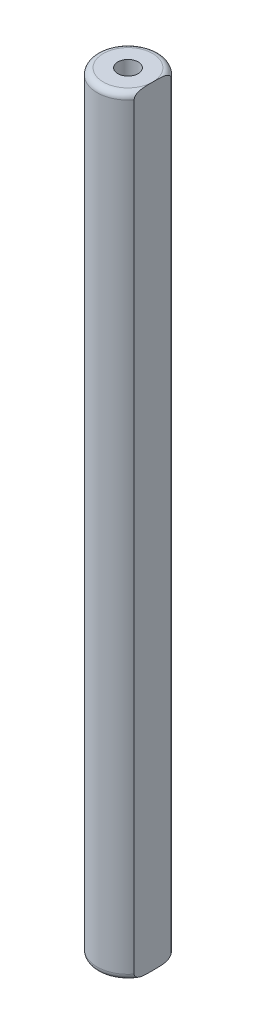
ISO-10303-21;
HEADER;
FILE_DESCRIPTION(('STEP AP214'),'2;1');
FILE_NAME('part.step','',(''),(''),'','','');
FILE_SCHEMA(('AUTOMOTIVE_DESIGN { 1 0 10303 214 1 1 1 1 }'));
ENDSEC;
DATA;
#1=APPLICATION_CONTEXT('core data for automotive mechanical design processes');
#2=APPLICATION_PROTOCOL_DEFINITION('international standard','automotive_design',2000,#1);
#3=PRODUCT_CONTEXT('',#1,'mechanical');
#4=PRODUCT('Part','Part','',(#3));
#5=PRODUCT_RELATED_PRODUCT_CATEGORY('part','',(#4));
#6=PRODUCT_DEFINITION_FORMATION('','',#4);
#7=PRODUCT_DEFINITION_CONTEXT('part definition',#1,'design');
#8=PRODUCT_DEFINITION('design','',#6,#7);
#9=PRODUCT_DEFINITION_SHAPE('','',#8);
#10=(LENGTH_UNIT() NAMED_UNIT(*) SI_UNIT(.MILLI.,.METRE.));
#11=(NAMED_UNIT(*) PLANE_ANGLE_UNIT() SI_UNIT($,.RADIAN.));
#12=(NAMED_UNIT(*) SI_UNIT($,.STERADIAN.) SOLID_ANGLE_UNIT());
#13=UNCERTAINTY_MEASURE_WITH_UNIT(LENGTH_MEASURE(1.E-05),#10,'distance_accuracy_value','');
#14=(GEOMETRIC_REPRESENTATION_CONTEXT(3) GLOBAL_UNCERTAINTY_ASSIGNED_CONTEXT((#13)) GLOBAL_UNIT_ASSIGNED_CONTEXT((#10,
#11,#12)) REPRESENTATION_CONTEXT('',''));
#15=CARTESIAN_POINT('',(0.,0.,0.));
#16=DIRECTION('',(0.,0.,1.));
#17=DIRECTION('',(1.,0.,0.));
#18=AXIS2_PLACEMENT_3D('',#15,#16,#17);
#19=CARTESIAN_POINT('',(0.,31.15,0.));
#20=DIRECTION('',(0.,-1.,0.));
#21=DIRECTION('',(0.,0.,-1.));
#22=AXIS2_PLACEMENT_3D('',#19,#20,#21);
#23=CYLINDRICAL_SURFACE('',#22,2.5);
#24=DIRECTION('',(0.,1.,0.));
#25=VECTOR('',#24,1.);
#26=CARTESIAN_POINT('',(2.,0.,-1.5));
#27=LINE('',#26,#25);
#28=CARTESIAN_POINT('',(2.,-30.65,-1.5));
#29=VERTEX_POINT('',#28);
#30=CARTESIAN_POINT('',(2.,30.65,-1.5));
#31=VERTEX_POINT('',#30);
#32=EDGE_CURVE('E80',#29,#31,#27,.T.);
#33=ORIENTED_EDGE('',*,*,#32,.F.);
#34=CARTESIAN_POINT('',(0.,-30.65,0.));
#35=DIRECTION('',(0.,-1.,0.));
#36=DIRECTION('',(0.,0.,-1.));
#37=AXIS2_PLACEMENT_3D('',#34,#35,#36);
#38=CIRCLE('',#37,2.5);
#39=CARTESIAN_POINT('',(2.,-30.65,1.5));
#40=VERTEX_POINT('',#39);
#41=EDGE_CURVE('E117',#29,#40,#38,.F.);
#42=ORIENTED_EDGE('',*,*,#41,.T.);
#43=DIRECTION('',(0.,1.,0.));
#44=VECTOR('',#43,1.);
#45=CARTESIAN_POINT('',(2.,0.,1.5));
#46=LINE('',#45,#44);
#47=CARTESIAN_POINT('',(2.,30.65,1.5));
#48=VERTEX_POINT('',#47);
#49=EDGE_CURVE('E122',#40,#48,#46,.T.);
#50=ORIENTED_EDGE('',*,*,#49,.T.);
#51=CARTESIAN_POINT('',(0.,30.65,0.));
#52=DIRECTION('',(0.,1.,0.));
#53=DIRECTION('',(0.,0.,1.));
#54=AXIS2_PLACEMENT_3D('',#51,#52,#53);
#55=CIRCLE('',#54,2.5);
#56=EDGE_CURVE('E75',#48,#31,#55,.F.);
#57=ORIENTED_EDGE('',*,*,#56,.T.);
#58=EDGE_LOOP('',(#33,#42,#50,#57));
#59=FACE_BOUND('',#58,.T.);
#60=ADVANCED_FACE('F33',(#59),#23,.T.);
#61=CARTESIAN_POINT('',(0.,-31.15,0.));
#62=DIRECTION('',(0.,-1.,0.));
#63=DIRECTION('',(0.,0.,1.));
#64=AXIS2_PLACEMENT_3D('',#61,#62,#63);
#65=PLANE('',#64);
#66=CARTESIAN_POINT('',(0.,-31.15,0.));
#67=DIRECTION('',(0.,-1.,0.));
#68=DIRECTION('',(0.,0.,-1.));
#69=AXIS2_PLACEMENT_3D('',#66,#67,#68);
#70=CIRCLE('',#69,2.);
#71=CARTESIAN_POINT('',(2.,-31.15,0.));
#72=VERTEX_POINT('',#71);
#73=EDGE_CURVE('E11',#72,#72,#70,.T.);
#74=ORIENTED_EDGE('',*,*,#73,.T.);
#75=EDGE_LOOP('',(#74));
#76=FACE_BOUND('',#75,.T.);
#77=CARTESIAN_POINT('',(0.,-31.15,0.));
#78=DIRECTION('',(0.,1.,0.));
#79=DIRECTION('',(0.,0.,1.));
#80=AXIS2_PLACEMENT_3D('',#77,#78,#79);
#81=CIRCLE('',#80,0.825);
#82=CARTESIAN_POINT('',(0.,-31.15,0.825));
#83=VERTEX_POINT('',#82);
#84=EDGE_CURVE('E134',#83,#83,#81,.T.);
#85=ORIENTED_EDGE('',*,*,#84,.T.);
#86=EDGE_LOOP('',(#85));
#87=FACE_BOUND('',#86,.T.);
#88=ADVANCED_FACE('F106',(#76,#87),#65,.T.);
#89=CARTESIAN_POINT('',(0.,31.15,0.));
#90=DIRECTION('',(0.,1.,0.));
#91=DIRECTION('',(0.,0.,1.));
#92=AXIS2_PLACEMENT_3D('',#89,#90,#91);
#93=PLANE('',#92);
#94=CARTESIAN_POINT('',(0.,31.15,0.));
#95=DIRECTION('',(0.,1.,0.));
#96=DIRECTION('',(0.,0.,1.));
#97=AXIS2_PLACEMENT_3D('',#94,#95,#96);
#98=CIRCLE('',#97,2.);
#99=CARTESIAN_POINT('',(2.,31.15,0.));
#100=VERTEX_POINT('',#99);
#101=EDGE_CURVE('E73',#100,#100,#98,.T.);
#102=ORIENTED_EDGE('',*,*,#101,.T.);
#103=EDGE_LOOP('',(#102));
#104=FACE_BOUND('',#103,.T.);
#105=CARTESIAN_POINT('',(0.,31.15,0.));
#106=DIRECTION('',(0.,1.,0.));
#107=DIRECTION('',(0.,0.,1.));
#108=AXIS2_PLACEMENT_3D('',#105,#106,#107);
#109=CIRCLE('',#108,0.825);
#110=CARTESIAN_POINT('',(0.,31.15,0.825));
#111=VERTEX_POINT('',#110);
#112=EDGE_CURVE('E88',#111,#111,#109,.T.);
#113=ORIENTED_EDGE('',*,*,#112,.F.);
#114=EDGE_LOOP('',(#113));
#115=FACE_BOUND('',#114,.T.);
#116=ADVANCED_FACE('F83',(#104,#115),#93,.T.);
#117=CARTESIAN_POINT('',(0.,26.15,0.));
#118=DIRECTION('',(0.,1.,0.));
#119=DIRECTION('',(0.,0.,1.));
#120=AXIS2_PLACEMENT_3D('',#117,#118,#119);
#121=CYLINDRICAL_SURFACE('',#120,0.825);
#122=CARTESIAN_POINT('',(0.,26.15,0.));
#123=DIRECTION('',(0.,1.,0.));
#124=DIRECTION('',(0.,0.,1.));
#125=AXIS2_PLACEMENT_3D('',#122,#123,#124);
#126=CIRCLE('',#125,0.825);
#127=CARTESIAN_POINT('',(0.,26.15,0.825));
#128=VERTEX_POINT('',#127);
#129=EDGE_CURVE('E85',#128,#128,#126,.T.);
#130=ORIENTED_EDGE('',*,*,#129,.F.);
#131=EDGE_LOOP('',(#130));
#132=FACE_BOUND('',#131,.T.);
#133=ORIENTED_EDGE('',*,*,#112,.T.);
#134=EDGE_LOOP('',(#133));
#135=FACE_BOUND('',#134,.T.);
#136=ADVANCED_FACE('F158',(#132,#135),#121,.F.);
#137=CARTESIAN_POINT('',(0.,26.15,0.));
#138=DIRECTION('',(0.,1.,0.));
#139=DIRECTION('',(0.,0.,1.));
#140=AXIS2_PLACEMENT_3D('',#137,#138,#139);
#141=PLANE('',#140);
#142=ORIENTED_EDGE('',*,*,#129,.T.);
#143=EDGE_LOOP('',(#142));
#144=FACE_BOUND('',#143,.T.);
#145=ADVANCED_FACE('F105',(#144),#141,.T.);
#146=CARTESIAN_POINT('',(2.,0.,-1.5));
#147=DIRECTION('',(-1.,0.,0.));
#148=DIRECTION('',(0.,0.,1.));
#149=AXIS2_PLACEMENT_3D('',#146,#147,#148);
#150=PLANE('',#149);
#151=ORIENTED_EDGE('',*,*,#49,.F.);
#152=CARTESIAN_POINT('',(2.,-30.65,1.5));
#153=CARTESIAN_POINT('',(2.,-30.6700065150284,1.50005508764519));
#154=CARTESIAN_POINT('',(2.,-30.6899505223803,1.49800297503596));
#155=CARTESIAN_POINT('',(2.,-30.7288908622129,1.49017103135305));
#156=CARTESIAN_POINT('',(2.,-30.747894786355,1.48442943896433));
#157=CARTESIAN_POINT('',(2.,-30.7845007170815,1.46971395516312));
#158=CARTESIAN_POINT('',(2.,-30.8021074472319,1.46075157527048));
#159=CARTESIAN_POINT('',(2.,-30.8357418270518,1.44018960181346));
#160=CARTESIAN_POINT('',(2.,-30.8517650844176,1.42858295243753));
#161=CARTESIAN_POINT('',(2.,-30.8889337995344,1.39760924057378));
#162=CARTESIAN_POINT('',(2.,-30.9091275913188,1.37710380043444));
#163=CARTESIAN_POINT('',(2.,-30.9460193785026,1.3332153788633));
#164=CARTESIAN_POINT('',(2.,-30.9627135559447,1.30982929844171));
#165=CARTESIAN_POINT('',(2.,-31.0025266059827,1.24588475655888));
#166=CARTESIAN_POINT('',(2.,-31.0231102761167,1.20375339504331));
#167=CARTESIAN_POINT('',(2.,-31.0492657628372,1.13857481760512));
#168=CARTESIAN_POINT('',(2.,-31.0572271665565,1.11639476146753));
#169=CARTESIAN_POINT('',(2.,-31.0717347834849,1.07158652733004));
#170=CARTESIAN_POINT('',(2.,-31.0782820228324,1.04895868735181));
#171=CARTESIAN_POINT('',(2.,-31.0954775535542,0.982989447767375));
#172=CARTESIAN_POINT('',(2.,-31.1045494991958,0.939240813702869));
#173=CARTESIAN_POINT('',(2.,-31.1194389319571,0.85118057519475));
#174=CARTESIAN_POINT('',(2.,-31.1252529100803,0.806868416119318));
#175=CARTESIAN_POINT('',(2.,-31.1345404183726,0.717748873858498));
#176=CARTESIAN_POINT('',(2.,-31.1380000262617,0.672940110398229));
#177=CARTESIAN_POINT('',(2.,-31.143276064899,0.583224127429996));
#178=CARTESIAN_POINT('',(2.,-31.1450920982067,0.53831688673903));
#179=CARTESIAN_POINT('',(2.,-31.1475884411658,0.45202717013826));
#180=CARTESIAN_POINT('',(2.,-31.148347176557,0.410646661478023));
#181=CARTESIAN_POINT('',(2.,-31.1493649293624,0.327877214900453));
#182=CARTESIAN_POINT('',(2.,-31.1496239046374,0.286488276566583));
#183=CARTESIAN_POINT('',(2.,-31.1499262759537,0.204245986253957));
#184=CARTESIAN_POINT('',(2.,-31.1499724201265,0.163392638975686));
#185=CARTESIAN_POINT('',(2.,-31.1499994454164,0.0816928216893287));
#186=CARTESIAN_POINT('',(2.,-31.1499803376138,0.0408463516913634));
#187=CARTESIAN_POINT('',(2.,-31.15,0.));
#188=B_SPLINE_CURVE_WITH_KNOTS('',3,(#152,#153,#154,#155,#156,#157,#158,#159,#160,#161,#162,
#163,#164,#165,#166,#167,#168,#169,#170,#171,#172,#173,#174,#175,#176,#177,#178,#179,#180,#181,
#182,#183,#184,#185,#186,#187),.UNSPECIFIED.,.F.,.F.,(4,2,2,2,2,2,2,2,2,2,2,2,2,2,2,2,2,4),(0.,
0.0598154823382512,0.119020807803603,0.178016596524446,0.237171689151975,0.323022405322561,
0.408966299732605,0.548800102010773,0.619474466309536,0.690097374684527,0.823948961414436,
0.957944437366599,1.09272554990601,1.2275392458054,1.35169671337948,1.47586464927862,
1.59842472260636,1.72096398530663),.UNSPECIFIED.);
#189=EDGE_CURVE('E42',#40,#72,#188,.T.);
#190=ORIENTED_EDGE('',*,*,#189,.T.);
#191=CARTESIAN_POINT('',(2.,-31.15,0.));
#192=CARTESIAN_POINT('',(2.,-31.149980484284,-0.0407626231076289));
#193=CARTESIAN_POINT('',(2.,-31.1499994433899,-0.0815253750922564));
#194=CARTESIAN_POINT('',(2.,-31.1499726519699,-0.163057529759021));
#195=CARTESIAN_POINT('',(2.,-31.1499268907924,-0.203826932431489));
#196=CARTESIAN_POINT('',(2.,-31.1496272394696,-0.285823216792328));
#197=CARTESIAN_POINT('',(2.,-31.1493710177251,-0.327050094241002));
#198=CARTESIAN_POINT('',(2.,-31.1483653267444,-0.409495794992682));
#199=CARTESIAN_POINT('',(2.,-31.1476158970779,-0.450714618676486));
#200=CARTESIAN_POINT('',(2.,-31.1452076449429,-0.534687159846425));
#201=CARTESIAN_POINT('',(2.,-31.1435155371863,-0.577440036322864));
#202=CARTESIAN_POINT('',(2.,-31.1386762279352,-0.662861842446352));
#203=CARTESIAN_POINT('',(2.,-31.1355293281928,-0.7055307876601));
#204=CARTESIAN_POINT('',(2.,-31.1271629448661,-0.790467964812874));
#205=CARTESIAN_POINT('',(2.,-31.1219534285849,-0.832737137282495));
#206=CARTESIAN_POINT('',(2.,-31.1087065375739,-0.916821134882456));
#207=CARTESIAN_POINT('',(2.,-31.1006717348776,-0.958636337716516));
#208=CARTESIAN_POINT('',(2.,-31.0868499282799,-1.01633423815903));
#209=CARTESIAN_POINT('',(2.,-31.0826447414506,-1.0325980627166));
#210=CARTESIAN_POINT('',(2.,-31.0735803939948,-1.06494846149724));
#211=CARTESIAN_POINT('',(2.,-31.0687209867408,-1.08103496638818));
#212=CARTESIAN_POINT('',(2.,-31.0530766101654,-1.12889043811801));
#213=CARTESIAN_POINT('',(2.,-31.0412104355907,-1.16032087149606));
#214=CARTESIAN_POINT('',(2.,-31.0138471087185,-1.22193787642586));
#215=CARTESIAN_POINT('',(2.,-30.9983172442343,-1.25211017751241));
#216=CARTESIAN_POINT('',(2.,-30.9629711649222,-1.30987180248264));
#217=CARTESIAN_POINT('',(2.,-30.9431618343013,-1.33746517402654));
#218=CARTESIAN_POINT('',(2.,-30.9063229296638,-1.37963467843693));
#219=CARTESIAN_POINT('',(2.,-30.890685118637,-1.39542133682361));
#220=CARTESIAN_POINT('',(2.,-30.8572261082969,-1.4245077100884));
#221=CARTESIAN_POINT('',(2.,-30.8394069701865,-1.43780974319198));
#222=CARTESIAN_POINT('',(2.,-30.8045634610992,-1.45935751669131));
#223=CARTESIAN_POINT('',(2.,-30.787825568107,-1.46806350146973));
#224=CARTESIAN_POINT('',(2.,-30.7531430315798,-1.48256312102217));
#225=CARTESIAN_POINT('',(2.,-30.7352009877708,-1.48836281472543));
#226=CARTESIAN_POINT('',(2.,-30.7059337018007,-1.49497096281988));
#227=CARTESIAN_POINT('',(2.,-30.6948421897842,-1.49684839330713));
#228=CARTESIAN_POINT('',(2.,-30.6725033908703,-1.49936626406293));
#229=CARTESIAN_POINT('',(2.,-30.6612558958349,-1.5000048503837));
#230=CARTESIAN_POINT('',(2.,-30.65,-1.5));
#231=B_SPLINE_CURVE_WITH_KNOTS('',3,(#191,#192,#193,#194,#195,#196,#197,#198,#199,#200,#201,
#202,#203,#204,#205,#206,#207,#208,#209,#210,#211,#212,#213,#214,#215,#216,#217,#218,#219,#220,
#221,#222,#223,#224,#225,#226,#227,#228,#229,#230),.UNSPECIFIED.,.F.,.F.,(4,2,2,2,2,2,2,2,2,2,2,
2,2,2,2,2,2,2,2,4),(0.,0.122288098502134,0.244596325308749,0.368278121933788,0.491949996900832,
0.620293921253729,0.748611236515071,0.876315899810973,1.00390460532892,1.05428854590096,
1.10469153363842,1.20529649885782,1.30683621704436,1.4082137927434,1.47468160162245,
1.54108708094665,1.5974625296124,1.65371995469663,1.68740390926937,1.72113823358775),.UNSPECIFIED.);
#232=EDGE_CURVE('E52',#72,#29,#231,.T.);
#233=ORIENTED_EDGE('',*,*,#232,.T.);
#234=ORIENTED_EDGE('',*,*,#32,.T.);
#235=CARTESIAN_POINT('',(2.,30.65,-1.5));
#236=CARTESIAN_POINT('',(2.,30.6700065150284,-1.50005508764519));
#237=CARTESIAN_POINT('',(2.,30.6899505223803,-1.49800297503596));
#238=CARTESIAN_POINT('',(2.,30.7288908622129,-1.49017103135305));
#239=CARTESIAN_POINT('',(2.,30.747894786355,-1.48442943896433));
#240=CARTESIAN_POINT('',(2.,30.7845007170815,-1.46971395516312));
#241=CARTESIAN_POINT('',(2.,30.8021074472319,-1.46075157527048));
#242=CARTESIAN_POINT('',(2.,30.8357418270518,-1.44018960181346));
#243=CARTESIAN_POINT('',(2.,30.8517650844176,-1.42858295243753));
#244=CARTESIAN_POINT('',(2.,30.8889337995344,-1.39760924057378));
#245=CARTESIAN_POINT('',(2.,30.9091275913188,-1.37710380043444));
#246=CARTESIAN_POINT('',(2.,30.9460193785026,-1.3332153788633));
#247=CARTESIAN_POINT('',(2.,30.9627135559447,-1.30982929844171));
#248=CARTESIAN_POINT('',(2.,31.0025266059827,-1.24588475655888));
#249=CARTESIAN_POINT('',(2.,31.0231102761167,-1.20375339504331));
#250=CARTESIAN_POINT('',(2.,31.0492657628372,-1.13857481760512));
#251=CARTESIAN_POINT('',(2.,31.0572271665565,-1.11639476146753));
#252=CARTESIAN_POINT('',(2.,31.0717347834849,-1.07158652733004));
#253=CARTESIAN_POINT('',(2.,31.0782820228324,-1.04895868735181));
#254=CARTESIAN_POINT('',(2.,31.0954775535542,-0.982989447767375));
#255=CARTESIAN_POINT('',(2.,31.1045494991958,-0.939240813702869));
#256=CARTESIAN_POINT('',(2.,31.1194389319571,-0.85118057519475));
#257=CARTESIAN_POINT('',(2.,31.1252529100803,-0.806868416119318));
#258=CARTESIAN_POINT('',(2.,31.1345404183726,-0.717748873858498));
#259=CARTESIAN_POINT('',(2.,31.1380000262617,-0.672940110398229));
#260=CARTESIAN_POINT('',(2.,31.143276064899,-0.583224127429996));
#261=CARTESIAN_POINT('',(2.,31.1450920982067,-0.53831688673903));
#262=CARTESIAN_POINT('',(2.,31.1475884411658,-0.45202717013826));
#263=CARTESIAN_POINT('',(2.,31.148347176557,-0.410646661478023));
#264=CARTESIAN_POINT('',(2.,31.1493649293624,-0.327877214900453));
#265=CARTESIAN_POINT('',(2.,31.1496239046374,-0.286488276566583));
#266=CARTESIAN_POINT('',(2.,31.1499262759537,-0.204245986253957));
#267=CARTESIAN_POINT('',(2.,31.1499724201265,-0.163392638975686));
#268=CARTESIAN_POINT('',(2.,31.1499994454164,-0.0816928216893287));
#269=CARTESIAN_POINT('',(2.,31.1499803376138,-0.0408463516913634));
#270=CARTESIAN_POINT('',(2.,31.15,0.));
#271=B_SPLINE_CURVE_WITH_KNOTS('',3,(#235,#236,#237,#238,#239,#240,#241,#242,#243,#244,#245,
#246,#247,#248,#249,#250,#251,#252,#253,#254,#255,#256,#257,#258,#259,#260,#261,#262,#263,#264,
#265,#266,#267,#268,#269,#270),.UNSPECIFIED.,.F.,.F.,(4,2,2,2,2,2,2,2,2,2,2,2,2,2,2,2,2,4),(0.,
0.0598154823382512,0.119020807803603,0.178016596524446,0.237171689151975,0.323022405322561,
0.408966299732605,0.548800102010773,0.619474466309536,0.690097374684527,0.823948961414436,
0.957944437366599,1.09272554990601,1.2275392458054,1.35169671337948,1.47586464927862,
1.59842472260636,1.72096398530663),.UNSPECIFIED.);
#272=EDGE_CURVE('E77',#31,#100,#271,.T.);
#273=ORIENTED_EDGE('',*,*,#272,.T.);
#274=CARTESIAN_POINT('',(2.,31.15,0.));
#275=CARTESIAN_POINT('',(2.,31.149980484284,0.0407626231076289));
#276=CARTESIAN_POINT('',(2.,31.1499994433899,0.0815253750922564));
#277=CARTESIAN_POINT('',(2.,31.1499726519699,0.163057529759021));
#278=CARTESIAN_POINT('',(2.,31.1499268907924,0.203826932431489));
#279=CARTESIAN_POINT('',(2.,31.1496272394696,0.285823216792328));
#280=CARTESIAN_POINT('',(2.,31.1493710177251,0.327050094241002));
#281=CARTESIAN_POINT('',(2.,31.1483653267444,0.409495794992682));
#282=CARTESIAN_POINT('',(2.,31.1476158970779,0.450714618676486));
#283=CARTESIAN_POINT('',(2.,31.1452076449429,0.534687159846425));
#284=CARTESIAN_POINT('',(2.,31.1435155371863,0.577440036322864));
#285=CARTESIAN_POINT('',(2.,31.1386762279352,0.662861842446352));
#286=CARTESIAN_POINT('',(2.,31.1355293281928,0.7055307876601));
#287=CARTESIAN_POINT('',(2.,31.1271629448661,0.790467964812874));
#288=CARTESIAN_POINT('',(2.,31.1219534285849,0.832737137282495));
#289=CARTESIAN_POINT('',(2.,31.1087065375739,0.916821134882456));
#290=CARTESIAN_POINT('',(2.,31.1006717348776,0.958636337716516));
#291=CARTESIAN_POINT('',(2.,31.0868499282799,1.01633423815903));
#292=CARTESIAN_POINT('',(2.,31.0826447414506,1.0325980627166));
#293=CARTESIAN_POINT('',(2.,31.0735803939948,1.06494846149724));
#294=CARTESIAN_POINT('',(2.,31.0687209867408,1.08103496638818));
#295=CARTESIAN_POINT('',(2.,31.0530766101654,1.12889043811801));
#296=CARTESIAN_POINT('',(2.,31.0412104355907,1.16032087149606));
#297=CARTESIAN_POINT('',(2.,31.0138471087185,1.22193787642586));
#298=CARTESIAN_POINT('',(2.,30.9983172442343,1.25211017751241));
#299=CARTESIAN_POINT('',(2.,30.9629711649222,1.30987180248264));
#300=CARTESIAN_POINT('',(2.,30.9431618343013,1.33746517402654));
#301=CARTESIAN_POINT('',(2.,30.9063229296638,1.37963467843693));
#302=CARTESIAN_POINT('',(2.,30.890685118637,1.39542133682361));
#303=CARTESIAN_POINT('',(2.,30.8572261082969,1.4245077100884));
#304=CARTESIAN_POINT('',(2.,30.8394069701865,1.43780974319198));
#305=CARTESIAN_POINT('',(2.,30.8045634610992,1.45935751669131));
#306=CARTESIAN_POINT('',(2.,30.787825568107,1.46806350146973));
#307=CARTESIAN_POINT('',(2.,30.7531430315798,1.48256312102217));
#308=CARTESIAN_POINT('',(2.,30.7352009877708,1.48836281472543));
#309=CARTESIAN_POINT('',(2.,30.7059337018007,1.49497096281988));
#310=CARTESIAN_POINT('',(2.,30.6948421897842,1.49684839330713));
#311=CARTESIAN_POINT('',(2.,30.6725033908703,1.49936626406293));
#312=CARTESIAN_POINT('',(2.,30.6612558958349,1.5000048503837));
#313=CARTESIAN_POINT('',(2.,30.65,1.5));
#314=B_SPLINE_CURVE_WITH_KNOTS('',3,(#274,#275,#276,#277,#278,#279,#280,#281,#282,#283,#284,
#285,#286,#287,#288,#289,#290,#291,#292,#293,#294,#295,#296,#297,#298,#299,#300,#301,#302,#303,
#304,#305,#306,#307,#308,#309,#310,#311,#312,#313),.UNSPECIFIED.,.F.,.F.,(4,2,2,2,2,2,2,2,2,2,2,
2,2,2,2,2,2,2,2,4),(0.,0.122288098502134,0.244596325308749,0.368278121933788,0.491949996900832,
0.620293921253729,0.748611236515071,0.876315899810973,1.00390460532892,1.05428854590096,
1.10469153363842,1.20529649885782,1.30683621704436,1.4082137927434,1.47468160162245,
1.54108708094665,1.5974625296124,1.65371995469663,1.68740390926937,1.72113823358775),.UNSPECIFIED.);
#315=EDGE_CURVE('E68',#100,#48,#314,.T.);
#316=ORIENTED_EDGE('',*,*,#315,.T.);
#317=EDGE_LOOP('',(#151,#190,#233,#234,#273,#316));
#318=FACE_BOUND('',#317,.T.);
#319=ADVANCED_FACE('F79',(#318),#150,.F.);
#320=CARTESIAN_POINT('',(0.,30.65,0.));
#321=DIRECTION('',(0.,1.,0.));
#322=DIRECTION('',(0.,0.,1.));
#323=AXIS2_PLACEMENT_3D('',#320,#321,#322);
#324=TOROIDAL_SURFACE('',#323,2.,0.5);
#325=ORIENTED_EDGE('',*,*,#272,.F.);
#326=ORIENTED_EDGE('',*,*,#56,.F.);
#327=ORIENTED_EDGE('',*,*,#315,.F.);
#328=ORIENTED_EDGE('',*,*,#101,.F.);
#329=EDGE_LOOP('',(#325,#326,#327,#328));
#330=FACE_BOUND('',#329,.T.);
#331=ADVANCED_FACE('F71',(#330),#324,.T.);
#332=CARTESIAN_POINT('',(0.,-26.15,0.));
#333=DIRECTION('',(0.,-1.,0.));
#334=DIRECTION('',(0.,0.,-1.));
#335=AXIS2_PLACEMENT_3D('',#332,#333,#334);
#336=CYLINDRICAL_SURFACE('',#335,0.825);
#337=CARTESIAN_POINT('',(0.,-26.15,0.));
#338=DIRECTION('',(0.,1.,0.));
#339=DIRECTION('',(0.,0.,1.));
#340=AXIS2_PLACEMENT_3D('',#337,#338,#339);
#341=CIRCLE('',#340,0.825);
#342=CARTESIAN_POINT('',(0.,-26.15,0.825));
#343=VERTEX_POINT('',#342);
#344=EDGE_CURVE('E132',#343,#343,#341,.T.);
#345=ORIENTED_EDGE('',*,*,#344,.T.);
#346=EDGE_LOOP('',(#345));
#347=FACE_BOUND('',#346,.T.);
#348=ORIENTED_EDGE('',*,*,#84,.F.);
#349=EDGE_LOOP('',(#348));
#350=FACE_BOUND('',#349,.T.);
#351=ADVANCED_FACE('F143',(#347,#350),#336,.F.);
#352=CARTESIAN_POINT('',(0.,-26.15,0.));
#353=DIRECTION('',(0.,-1.,0.));
#354=DIRECTION('',(0.,0.,1.));
#355=AXIS2_PLACEMENT_3D('',#352,#353,#354);
#356=PLANE('',#355);
#357=ORIENTED_EDGE('',*,*,#344,.F.);
#358=EDGE_LOOP('',(#357));
#359=FACE_BOUND('',#358,.T.);
#360=ADVANCED_FACE('F145',(#359),#356,.T.);
#361=CARTESIAN_POINT('',(0.,-30.65,0.));
#362=DIRECTION('',(0.,-1.,0.));
#363=DIRECTION('',(0.,0.,-1.));
#364=AXIS2_PLACEMENT_3D('',#361,#362,#363);
#365=TOROIDAL_SURFACE('',#364,2.,0.5);
#366=ORIENTED_EDGE('',*,*,#232,.F.);
#367=ORIENTED_EDGE('',*,*,#73,.F.);
#368=ORIENTED_EDGE('',*,*,#189,.F.);
#369=ORIENTED_EDGE('',*,*,#41,.F.);
#370=EDGE_LOOP('',(#366,#367,#368,#369));
#371=FACE_BOUND('',#370,.T.);
#372=ADVANCED_FACE('F35',(#371),#365,.T.);
#373=CLOSED_SHELL('',(#60,#88,#116,#136,#145,#319,#331,#351,#360,#372));
#374=MANIFOLD_SOLID_BREP('B2',#373);
#375=ADVANCED_BREP_SHAPE_REPRESENTATION('',(#18,#374),#14);
#376=SHAPE_DEFINITION_REPRESENTATION(#9,#375);
ENDSEC;
END-ISO-10303-21;
